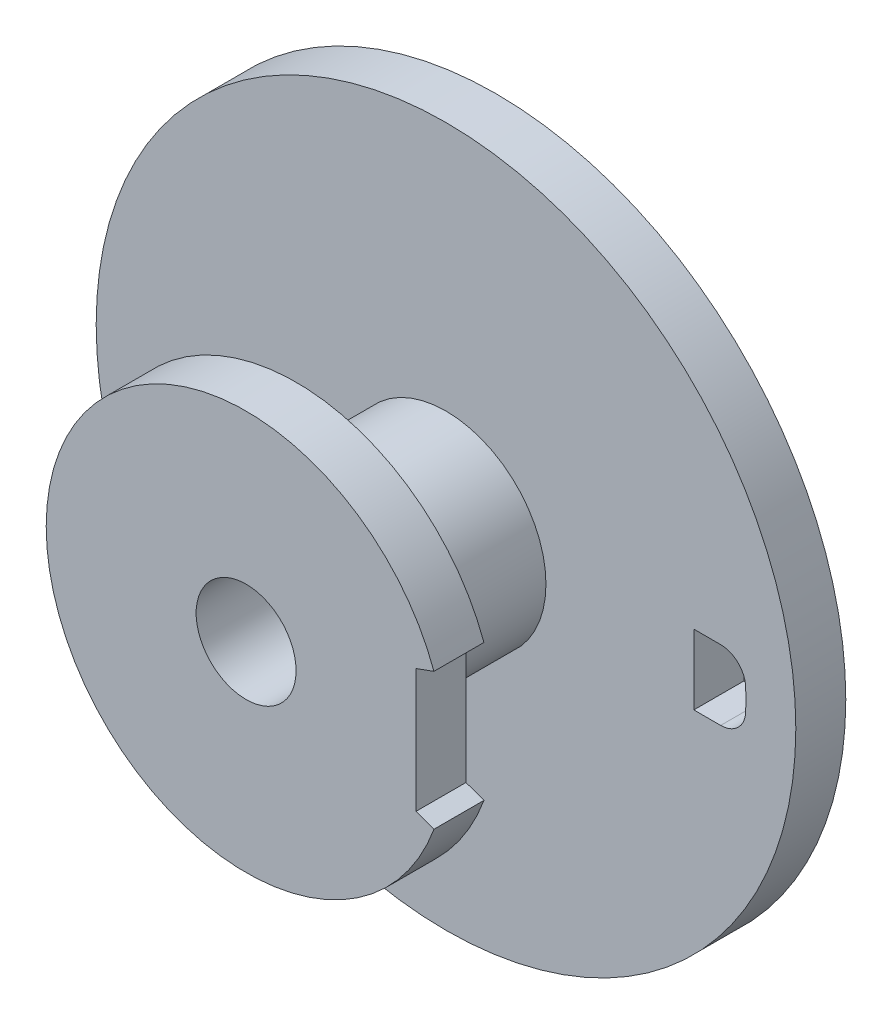
ISO-10303-21;
HEADER;
FILE_DESCRIPTION(('STEP AP214'),'2;1');
FILE_NAME('part.step','',(''),(''),'','','');
FILE_SCHEMA(('AUTOMOTIVE_DESIGN { 1 0 10303 214 1 1 1 1 }'));
ENDSEC;
DATA;
#1=APPLICATION_CONTEXT('core data for automotive mechanical design processes');
#2=APPLICATION_PROTOCOL_DEFINITION('international standard','automotive_design',2000,#1);
#3=PRODUCT_CONTEXT('',#1,'mechanical');
#4=PRODUCT('Part','Part','',(#3));
#5=PRODUCT_RELATED_PRODUCT_CATEGORY('part','',(#4));
#6=PRODUCT_DEFINITION_FORMATION('','',#4);
#7=PRODUCT_DEFINITION_CONTEXT('part definition',#1,'design');
#8=PRODUCT_DEFINITION('design','',#6,#7);
#9=PRODUCT_DEFINITION_SHAPE('','',#8);
#10=(LENGTH_UNIT() NAMED_UNIT(*) SI_UNIT(.MILLI.,.METRE.));
#11=(NAMED_UNIT(*) PLANE_ANGLE_UNIT() SI_UNIT($,.RADIAN.));
#12=(NAMED_UNIT(*) SI_UNIT($,.STERADIAN.) SOLID_ANGLE_UNIT());
#13=UNCERTAINTY_MEASURE_WITH_UNIT(LENGTH_MEASURE(1.E-05),#10,'distance_accuracy_value','');
#14=(GEOMETRIC_REPRESENTATION_CONTEXT(3) GLOBAL_UNCERTAINTY_ASSIGNED_CONTEXT((#13)) GLOBAL_UNIT_ASSIGNED_CONTEXT((#10,
#11,#12)) REPRESENTATION_CONTEXT('',''));
#15=CARTESIAN_POINT('',(0.,0.,0.));
#16=DIRECTION('',(0.,0.,1.));
#17=DIRECTION('',(1.,0.,0.));
#18=AXIS2_PLACEMENT_3D('',#15,#16,#17);
#19=CARTESIAN_POINT('',(0.,0.,-0.75));
#20=DIRECTION('',(0.,0.,1.));
#21=DIRECTION('',(1.,0.,0.));
#22=AXIS2_PLACEMENT_3D('',#19,#20,#21);
#23=CYLINDRICAL_SURFACE('',#22,0.5);
#24=CARTESIAN_POINT('',(0.,0.,-0.75));
#25=DIRECTION('',(0.,0.,-1.));
#26=DIRECTION('',(-1.,0.,0.));
#27=AXIS2_PLACEMENT_3D('',#24,#25,#26);
#28=CIRCLE('',#27,0.5);
#29=CARTESIAN_POINT('',(-0.5,0.,-0.75));
#30=VERTEX_POINT('',#29);
#31=EDGE_CURVE('E165',#30,#30,#28,.F.);
#32=ORIENTED_EDGE('',*,*,#31,.T.);
#33=EDGE_LOOP('',(#32));
#34=FACE_BOUND('',#33,.T.);
#35=CARTESIAN_POINT('',(0.,0.,0.));
#36=DIRECTION('',(0.,0.,1.));
#37=DIRECTION('',(1.,0.,0.));
#38=AXIS2_PLACEMENT_3D('',#35,#36,#37);
#39=CIRCLE('',#38,0.5);
#40=CARTESIAN_POINT('',(0.5,0.,0.));
#41=VERTEX_POINT('',#40);
#42=EDGE_CURVE('E11',#41,#41,#39,.T.);
#43=ORIENTED_EDGE('',*,*,#42,.F.);
#44=EDGE_LOOP('',(#43));
#45=FACE_BOUND('',#44,.T.);
#46=ADVANCED_FACE('F34',(#34,#45),#23,.T.);
#47=CARTESIAN_POINT('',(0.,0.,-0.75));
#48=DIRECTION('',(0.,0.,1.));
#49=DIRECTION('',(1.,0.,0.));
#50=AXIS2_PLACEMENT_3D('',#47,#48,#49);
#51=CYLINDRICAL_SURFACE('',#50,0.25);
#52=CARTESIAN_POINT('',(0.,0.,0.25));
#53=DIRECTION('',(0.,0.,1.));
#54=DIRECTION('',(1.,0.,0.));
#55=AXIS2_PLACEMENT_3D('',#52,#53,#54);
#56=CIRCLE('',#55,0.25);
#57=CARTESIAN_POINT('',(0.25,0.,0.25));
#58=VERTEX_POINT('',#57);
#59=EDGE_CURVE('E170',#58,#58,#56,.T.);
#60=ORIENTED_EDGE('',*,*,#59,.T.);
#61=EDGE_LOOP('',(#60));
#62=FACE_BOUND('',#61,.T.);
#63=CARTESIAN_POINT('',(0.,0.,-1.));
#64=DIRECTION('',(0.,0.,-1.));
#65=DIRECTION('',(-1.,0.,0.));
#66=AXIS2_PLACEMENT_3D('',#63,#64,#65);
#67=CIRCLE('',#66,0.25);
#68=CARTESIAN_POINT('',(-0.25,0.,-1.));
#69=VERTEX_POINT('',#68);
#70=EDGE_CURVE('E124',#69,#69,#67,.T.);
#71=ORIENTED_EDGE('',*,*,#70,.T.);
#72=EDGE_LOOP('',(#71));
#73=FACE_BOUND('',#72,.T.);
#74=ADVANCED_FACE('F233',(#62,#73),#51,.F.);
#75=CARTESIAN_POINT('',(0.,0.,0.25));
#76=DIRECTION('',(0.,0.,1.));
#77=DIRECTION('',(1.,0.,0.));
#78=AXIS2_PLACEMENT_3D('',#75,#76,#77);
#79=PLANE('',#78);
#80=CARTESIAN_POINT('',(0.,0.,0.25));
#81=DIRECTION('',(0.,0.,1.));
#82=DIRECTION('',(1.,0.,0.));
#83=AXIS2_PLACEMENT_3D('',#80,#81,#82);
#84=CIRCLE('',#83,1.);
#85=CARTESIAN_POINT('',(0.939692620785908,0.342020143325669,0.25));
#86=VERTEX_POINT('',#85);
#87=CARTESIAN_POINT('',(0.939692620785908,-0.342020143325669,0.25));
#88=VERTEX_POINT('',#87);
#89=EDGE_CURVE('E174',#86,#88,#84,.T.);
#90=ORIENTED_EDGE('',*,*,#89,.T.);
#91=DIRECTION('',(-0.939692620785908,0.34202014332567,0.));
#92=VECTOR('',#91,1.);
#93=CARTESIAN_POINT('',(0.85,-0.309374699126273,0.25));
#94=LINE('',#93,#92);
#95=CARTESIAN_POINT('',(0.85,-0.309374699126273,0.25));
#96=VERTEX_POINT('',#95);
#97=EDGE_CURVE('E176',#88,#96,#94,.T.);
#98=ORIENTED_EDGE('',*,*,#97,.T.);
#99=DIRECTION('',(0.,1.,0.));
#100=VECTOR('',#99,1.);
#101=CARTESIAN_POINT('',(0.85,0.309374699126273,0.25));
#102=LINE('',#101,#100);
#103=CARTESIAN_POINT('',(0.85,0.309374699126273,0.25));
#104=VERTEX_POINT('',#103);
#105=EDGE_CURVE('E179',#96,#104,#102,.T.);
#106=ORIENTED_EDGE('',*,*,#105,.T.);
#107=DIRECTION('',(0.939692620785908,0.342020143325669,0.));
#108=VECTOR('',#107,1.);
#109=CARTESIAN_POINT('',(0.85,0.309374699126273,0.25));
#110=LINE('',#109,#108);
#111=EDGE_CURVE('E181',#104,#86,#110,.T.);
#112=ORIENTED_EDGE('',*,*,#111,.T.);
#113=EDGE_LOOP('',(#90,#98,#106,#112));
#114=FACE_BOUND('',#113,.T.);
#115=ORIENTED_EDGE('',*,*,#59,.F.);
#116=EDGE_LOOP('',(#115));
#117=FACE_BOUND('',#116,.T.);
#118=ADVANCED_FACE('F220',(#114,#117),#79,.T.);
#119=CARTESIAN_POINT('',(0.,0.,0.));
#120=DIRECTION('',(0.,0.,1.));
#121=DIRECTION('',(1.,0.,0.));
#122=AXIS2_PLACEMENT_3D('',#119,#120,#121);
#123=PLANE('',#122);
#124=ORIENTED_EDGE('',*,*,#42,.T.);
#125=EDGE_LOOP('',(#124));
#126=FACE_BOUND('',#125,.T.);
#127=CARTESIAN_POINT('',(0.,0.,0.));
#128=DIRECTION('',(0.,0.,1.));
#129=DIRECTION('',(1.,0.,0.));
#130=AXIS2_PLACEMENT_3D('',#127,#128,#129);
#131=CIRCLE('',#130,1.);
#132=CARTESIAN_POINT('',(0.939692620785908,0.342020143325669,0.));
#133=VERTEX_POINT('',#132);
#134=CARTESIAN_POINT('',(0.939692620785908,-0.342020143325669,0.));
#135=VERTEX_POINT('',#134);
#136=EDGE_CURVE('E173',#133,#135,#131,.T.);
#137=ORIENTED_EDGE('',*,*,#136,.F.);
#138=DIRECTION('',(0.939692620785908,0.342020143325669,0.));
#139=VECTOR('',#138,1.);
#140=CARTESIAN_POINT('',(0.85,0.309374699126273,0.));
#141=LINE('',#140,#139);
#142=CARTESIAN_POINT('',(0.85,0.309374699126273,0.));
#143=VERTEX_POINT('',#142);
#144=EDGE_CURVE('E177',#143,#133,#141,.T.);
#145=ORIENTED_EDGE('',*,*,#144,.F.);
#146=DIRECTION('',(0.,1.,0.));
#147=VECTOR('',#146,1.);
#148=CARTESIAN_POINT('',(0.85,0.309374699126273,0.));
#149=LINE('',#148,#147);
#150=CARTESIAN_POINT('',(0.85,-0.309374699126273,0.));
#151=VERTEX_POINT('',#150);
#152=EDGE_CURVE('E187',#151,#143,#149,.T.);
#153=ORIENTED_EDGE('',*,*,#152,.F.);
#154=DIRECTION('',(-0.939692620785908,0.34202014332567,0.));
#155=VECTOR('',#154,1.);
#156=CARTESIAN_POINT('',(0.85,-0.309374699126273,0.));
#157=LINE('',#156,#155);
#158=EDGE_CURVE('E185',#135,#151,#157,.T.);
#159=ORIENTED_EDGE('',*,*,#158,.F.);
#160=EDGE_LOOP('',(#137,#145,#153,#159));
#161=FACE_BOUND('',#160,.T.);
#162=ADVANCED_FACE('F209',(#126,#161),#123,.F.);
#163=CARTESIAN_POINT('',(0.,0.,0.25));
#164=DIRECTION('',(0.,0.,-1.));
#165=DIRECTION('',(-1.,0.,0.));
#166=AXIS2_PLACEMENT_3D('',#163,#164,#165);
#167=CYLINDRICAL_SURFACE('',#166,1.);
#168=ORIENTED_EDGE('',*,*,#136,.T.);
#169=DIRECTION('',(0.,0.,-1.));
#170=VECTOR('',#169,1.);
#171=CARTESIAN_POINT('',(0.939692620785908,-0.342020143325669,0.25));
#172=LINE('',#171,#170);
#173=EDGE_CURVE('E41',#88,#135,#172,.T.);
#174=ORIENTED_EDGE('',*,*,#173,.F.);
#175=ORIENTED_EDGE('',*,*,#89,.F.);
#176=DIRECTION('',(0.,0.,-1.));
#177=VECTOR('',#176,1.);
#178=CARTESIAN_POINT('',(0.939692620785908,0.342020143325669,0.25));
#179=LINE('',#178,#177);
#180=EDGE_CURVE('E183',#86,#133,#179,.T.);
#181=ORIENTED_EDGE('',*,*,#180,.T.);
#182=EDGE_LOOP('',(#168,#174,#175,#181));
#183=FACE_BOUND('',#182,.T.);
#184=ADVANCED_FACE('F222',(#183),#167,.T.);
#185=CARTESIAN_POINT('',(0.85,-0.309374699126273,0.25));
#186=DIRECTION('',(-0.34202014332567,-0.939692620785908,0.));
#187=DIRECTION('',(0.939692620785908,-0.34202014332567,0.));
#188=AXIS2_PLACEMENT_3D('',#185,#186,#187);
#189=PLANE('',#188);
#190=ORIENTED_EDGE('',*,*,#158,.T.);
#191=DIRECTION('',(0.,0.,-1.));
#192=VECTOR('',#191,1.);
#193=CARTESIAN_POINT('',(0.85,-0.309374699126273,0.25));
#194=LINE('',#193,#192);
#195=EDGE_CURVE('E196',#96,#151,#194,.T.);
#196=ORIENTED_EDGE('',*,*,#195,.F.);
#197=ORIENTED_EDGE('',*,*,#97,.F.);
#198=ORIENTED_EDGE('',*,*,#173,.T.);
#199=EDGE_LOOP('',(#190,#196,#197,#198));
#200=FACE_BOUND('',#199,.T.);
#201=ADVANCED_FACE('F203',(#200),#189,.F.);
#202=CARTESIAN_POINT('',(0.85,0.309374699126273,0.25));
#203=DIRECTION('',(-1.,0.,0.));
#204=DIRECTION('',(0.,-1.,0.));
#205=AXIS2_PLACEMENT_3D('',#202,#203,#204);
#206=PLANE('',#205);
#207=ORIENTED_EDGE('',*,*,#152,.T.);
#208=DIRECTION('',(0.,0.,-1.));
#209=VECTOR('',#208,1.);
#210=CARTESIAN_POINT('',(0.85,0.309374699126273,0.25));
#211=LINE('',#210,#209);
#212=EDGE_CURVE('E193',#104,#143,#211,.T.);
#213=ORIENTED_EDGE('',*,*,#212,.F.);
#214=ORIENTED_EDGE('',*,*,#105,.F.);
#215=ORIENTED_EDGE('',*,*,#195,.T.);
#216=EDGE_LOOP('',(#207,#213,#214,#215));
#217=FACE_BOUND('',#216,.T.);
#218=ADVANCED_FACE('F213',(#217),#206,.F.);
#219=CARTESIAN_POINT('',(0.85,0.309374699126273,0.25));
#220=DIRECTION('',(-0.342020143325669,0.939692620785908,0.));
#221=DIRECTION('',(-0.939692620785908,-0.342020143325669,0.));
#222=AXIS2_PLACEMENT_3D('',#219,#220,#221);
#223=PLANE('',#222);
#224=ORIENTED_EDGE('',*,*,#144,.T.);
#225=ORIENTED_EDGE('',*,*,#180,.F.);
#226=ORIENTED_EDGE('',*,*,#111,.F.);
#227=ORIENTED_EDGE('',*,*,#212,.T.);
#228=EDGE_LOOP('',(#224,#225,#226,#227));
#229=FACE_BOUND('',#228,.T.);
#230=ADVANCED_FACE('F217',(#229),#223,.F.);
#231=CARTESIAN_POINT('',(0.,0.,-1.));
#232=DIRECTION('',(0.,0.,-1.));
#233=DIRECTION('',(-1.,0.,0.));
#234=AXIS2_PLACEMENT_3D('',#231,#232,#233);
#235=PLANE('',#234);
#236=DIRECTION('',(0.,1.,0.));
#237=VECTOR('',#236,1.);
#238=CARTESIAN_POINT('',(1.23975669154396,0.175,-1.));
#239=LINE('',#238,#237);
#240=CARTESIAN_POINT('',(1.23975669154396,-0.175,-1.));
#241=VERTEX_POINT('',#240);
#242=CARTESIAN_POINT('',(1.23975669154396,0.175,-1.));
#243=VERTEX_POINT('',#242);
#244=EDGE_CURVE('E48',#241,#243,#239,.T.);
#245=ORIENTED_EDGE('',*,*,#244,.F.);
#246=DIRECTION('',(-1.,0.,0.));
#247=VECTOR('',#246,1.);
#248=CARTESIAN_POINT('',(1.23975669154396,-0.175,-1.));
#249=LINE('',#248,#247);
#250=CARTESIAN_POINT('',(1.37409060836613,-0.175,-1.));
#251=VERTEX_POINT('',#250);
#252=EDGE_CURVE('E118',#251,#241,#249,.T.);
#253=ORIENTED_EDGE('',*,*,#252,.F.);
#254=CARTESIAN_POINT('',(1.37409060836613,-0.05,-1.));
#255=DIRECTION('',(0.,0.,-1.));
#256=DIRECTION('',(1.,0.,0.));
#257=AXIS2_PLACEMENT_3D('',#254,#255,#256);
#258=CIRCLE('',#257,0.125);
#259=CARTESIAN_POINT('',(1.49900793639941,-0.0545454545454545,-1.));
#260=VERTEX_POINT('',#259);
#261=EDGE_CURVE('E146',#260,#251,#258,.T.);
#262=ORIENTED_EDGE('',*,*,#261,.F.);
#263=CARTESIAN_POINT('',(0.,0.,-1.));
#264=DIRECTION('',(0.,0.,-1.));
#265=DIRECTION('',(-1.,0.,0.));
#266=AXIS2_PLACEMENT_3D('',#263,#264,#265);
#267=CIRCLE('',#266,1.5);
#268=CARTESIAN_POINT('',(1.49900793639941,0.0545454545454546,-1.));
#269=VERTEX_POINT('',#268);
#270=EDGE_CURVE('E143',#269,#260,#267,.T.);
#271=ORIENTED_EDGE('',*,*,#270,.F.);
#272=CARTESIAN_POINT('',(1.37409060836613,0.05,-1.));
#273=DIRECTION('',(0.,0.,-1.));
#274=DIRECTION('',(-1.,0.,0.));
#275=AXIS2_PLACEMENT_3D('',#272,#273,#274);
#276=CIRCLE('',#275,0.125);
#277=CARTESIAN_POINT('',(1.37409060836613,0.175,-1.));
#278=VERTEX_POINT('',#277);
#279=EDGE_CURVE('E140',#278,#269,#276,.T.);
#280=ORIENTED_EDGE('',*,*,#279,.F.);
#281=DIRECTION('',(1.,0.,0.));
#282=VECTOR('',#281,1.);
#283=CARTESIAN_POINT('',(1.37409060836613,0.175,-1.));
#284=LINE('',#283,#282);
#285=EDGE_CURVE('E133',#243,#278,#284,.T.);
#286=ORIENTED_EDGE('',*,*,#285,.F.);
#287=EDGE_LOOP('',(#245,#253,#262,#271,#280,#286));
#288=FACE_BOUND('',#287,.T.);
#289=CARTESIAN_POINT('',(0.,0.,-1.));
#290=DIRECTION('',(0.,0.,-1.));
#291=DIRECTION('',(-1.,0.,0.));
#292=AXIS2_PLACEMENT_3D('',#289,#290,#291);
#293=CIRCLE('',#292,1.75);
#294=CARTESIAN_POINT('',(-1.75,0.,-1.));
#295=VERTEX_POINT('',#294);
#296=EDGE_CURVE('E162',#295,#295,#293,.T.);
#297=ORIENTED_EDGE('',*,*,#296,.T.);
#298=EDGE_LOOP('',(#297));
#299=FACE_BOUND('',#298,.T.);
#300=ORIENTED_EDGE('',*,*,#70,.F.);
#301=EDGE_LOOP('',(#300));
#302=FACE_BOUND('',#301,.T.);
#303=ADVANCED_FACE('F245',(#288,#299,#302),#235,.T.);
#304=CARTESIAN_POINT('',(0.,0.,-0.75));
#305=DIRECTION('',(0.,0.,-1.));
#306=DIRECTION('',(-1.,0.,0.));
#307=AXIS2_PLACEMENT_3D('',#304,#305,#306);
#308=PLANE('',#307);
#309=DIRECTION('',(1.,0.,0.));
#310=VECTOR('',#309,1.);
#311=CARTESIAN_POINT('',(1.23975669154396,-0.175,-0.75));
#312=LINE('',#311,#310);
#313=CARTESIAN_POINT('',(1.23975669154396,-0.175,-0.75));
#314=VERTEX_POINT('',#313);
#315=CARTESIAN_POINT('',(1.37409060836613,-0.175,-0.75));
#316=VERTEX_POINT('',#315);
#317=EDGE_CURVE('E131',#314,#316,#312,.T.);
#318=ORIENTED_EDGE('',*,*,#317,.F.);
#319=DIRECTION('',(0.,-1.,0.));
#320=VECTOR('',#319,1.);
#321=CARTESIAN_POINT('',(1.23975669154396,0.175,-0.75));
#322=LINE('',#321,#320);
#323=CARTESIAN_POINT('',(1.23975669154396,0.175,-0.75));
#324=VERTEX_POINT('',#323);
#325=EDGE_CURVE('E112',#324,#314,#322,.T.);
#326=ORIENTED_EDGE('',*,*,#325,.F.);
#327=DIRECTION('',(-1.,0.,0.));
#328=VECTOR('',#327,1.);
#329=CARTESIAN_POINT('',(1.37409060836613,0.175,-0.75));
#330=LINE('',#329,#328);
#331=CARTESIAN_POINT('',(1.37409060836613,0.175,-0.75));
#332=VERTEX_POINT('',#331);
#333=EDGE_CURVE('E121',#332,#324,#330,.T.);
#334=ORIENTED_EDGE('',*,*,#333,.F.);
#335=CARTESIAN_POINT('',(1.37409060836613,0.05,-0.75));
#336=DIRECTION('',(0.,0.,-1.));
#337=DIRECTION('',(-1.,0.,0.));
#338=AXIS2_PLACEMENT_3D('',#335,#336,#337);
#339=CIRCLE('',#338,0.125);
#340=CARTESIAN_POINT('',(1.49900793639941,0.0545454545454546,-0.75));
#341=VERTEX_POINT('',#340);
#342=EDGE_CURVE('E56',#341,#332,#339,.F.);
#343=ORIENTED_EDGE('',*,*,#342,.F.);
#344=CARTESIAN_POINT('',(0.,0.,-0.75));
#345=DIRECTION('',(0.,0.,-1.));
#346=DIRECTION('',(-1.,0.,0.));
#347=AXIS2_PLACEMENT_3D('',#344,#345,#346);
#348=CIRCLE('',#347,1.5);
#349=CARTESIAN_POINT('',(1.49900793639941,-0.0545454545454545,-0.75));
#350=VERTEX_POINT('',#349);
#351=EDGE_CURVE('E406',#350,#341,#348,.F.);
#352=ORIENTED_EDGE('',*,*,#351,.F.);
#353=CARTESIAN_POINT('',(1.37409060836613,-0.05,-0.75));
#354=DIRECTION('',(0.,0.,-1.));
#355=DIRECTION('',(-1.,0.,0.));
#356=AXIS2_PLACEMENT_3D('',#353,#354,#355);
#357=CIRCLE('',#356,0.125);
#358=EDGE_CURVE('E135',#316,#350,#357,.F.);
#359=ORIENTED_EDGE('',*,*,#358,.F.);
#360=EDGE_LOOP('',(#318,#326,#334,#343,#352,#359));
#361=FACE_BOUND('',#360,.T.);
#362=ORIENTED_EDGE('',*,*,#31,.F.);
#363=EDGE_LOOP('',(#362));
#364=FACE_BOUND('',#363,.T.);
#365=CARTESIAN_POINT('',(0.,0.,-0.75));
#366=DIRECTION('',(0.,0.,-1.));
#367=DIRECTION('',(-1.,0.,0.));
#368=AXIS2_PLACEMENT_3D('',#365,#366,#367);
#369=CIRCLE('',#368,1.75);
#370=CARTESIAN_POINT('',(-1.75,0.,-0.75));
#371=VERTEX_POINT('',#370);
#372=EDGE_CURVE('E161',#371,#371,#369,.T.);
#373=ORIENTED_EDGE('',*,*,#372,.F.);
#374=EDGE_LOOP('',(#373));
#375=FACE_BOUND('',#374,.T.);
#376=ADVANCED_FACE('F127',(#361,#364,#375),#308,.F.);
#377=CARTESIAN_POINT('',(0.,0.,-1.));
#378=DIRECTION('',(0.,0.,1.));
#379=DIRECTION('',(1.,0.,0.));
#380=AXIS2_PLACEMENT_3D('',#377,#378,#379);
#381=CYLINDRICAL_SURFACE('',#380,1.75);
#382=ORIENTED_EDGE('',*,*,#296,.F.);
#383=EDGE_LOOP('',(#382));
#384=FACE_BOUND('',#383,.T.);
#385=ORIENTED_EDGE('',*,*,#372,.T.);
#386=EDGE_LOOP('',(#385));
#387=FACE_BOUND('',#386,.T.);
#388=ADVANCED_FACE('F244',(#384,#387),#381,.T.);
#389=CARTESIAN_POINT('',(1.23975669154396,0.175,0.251));
#390=DIRECTION('',(-1.,0.,0.));
#391=DIRECTION('',(0.,-1.,0.));
#392=AXIS2_PLACEMENT_3D('',#389,#390,#391);
#393=PLANE('',#392);
#394=ORIENTED_EDGE('',*,*,#325,.T.);
#395=DIRECTION('',(0.,0.,-1.));
#396=VECTOR('',#395,1.);
#397=CARTESIAN_POINT('',(1.23975669154396,-0.175,0.251));
#398=LINE('',#397,#396);
#399=EDGE_CURVE('E125',#314,#241,#398,.T.);
#400=ORIENTED_EDGE('',*,*,#399,.T.);
#401=ORIENTED_EDGE('',*,*,#244,.T.);
#402=DIRECTION('',(0.,0.,-1.));
#403=VECTOR('',#402,1.);
#404=CARTESIAN_POINT('',(1.23975669154396,0.175,0.251));
#405=LINE('',#404,#403);
#406=EDGE_CURVE('E108',#324,#243,#405,.T.);
#407=ORIENTED_EDGE('',*,*,#406,.F.);
#408=EDGE_LOOP('',(#394,#400,#401,#407));
#409=FACE_BOUND('',#408,.T.);
#410=ADVANCED_FACE('F110',(#409),#393,.F.);
#411=CARTESIAN_POINT('',(1.23975669154396,-0.175,0.251));
#412=DIRECTION('',(0.,-1.,0.));
#413=DIRECTION('',(1.,0.,0.));
#414=AXIS2_PLACEMENT_3D('',#411,#412,#413);
#415=PLANE('',#414);
#416=ORIENTED_EDGE('',*,*,#317,.T.);
#417=DIRECTION('',(0.,0.,-1.));
#418=VECTOR('',#417,1.);
#419=CARTESIAN_POINT('',(1.37409060836613,-0.175,0.251));
#420=LINE('',#419,#418);
#421=EDGE_CURVE('E152',#316,#251,#420,.T.);
#422=ORIENTED_EDGE('',*,*,#421,.T.);
#423=ORIENTED_EDGE('',*,*,#252,.T.);
#424=ORIENTED_EDGE('',*,*,#399,.F.);
#425=EDGE_LOOP('',(#416,#422,#423,#424));
#426=FACE_BOUND('',#425,.T.);
#427=ADVANCED_FACE('F255',(#426),#415,.F.);
#428=CARTESIAN_POINT('',(1.37409060836613,-0.05,0.251));
#429=DIRECTION('',(0.,0.,-1.));
#430=DIRECTION('',(-1.,0.,0.));
#431=AXIS2_PLACEMENT_3D('',#428,#429,#430);
#432=CYLINDRICAL_SURFACE('',#431,0.125);
#433=ORIENTED_EDGE('',*,*,#358,.T.);
#434=DIRECTION('',(0.,0.,-1.));
#435=VECTOR('',#434,1.);
#436=CARTESIAN_POINT('',(1.49900793639941,-0.0545454545454545,0.251));
#437=LINE('',#436,#435);
#438=EDGE_CURVE('E154',#350,#260,#437,.T.);
#439=ORIENTED_EDGE('',*,*,#438,.T.);
#440=ORIENTED_EDGE('',*,*,#261,.T.);
#441=ORIENTED_EDGE('',*,*,#421,.F.);
#442=EDGE_LOOP('',(#433,#439,#440,#441));
#443=FACE_BOUND('',#442,.T.);
#444=ADVANCED_FACE('F363',(#443),#432,.F.);
#445=CARTESIAN_POINT('',(0.,0.,0.251));
#446=DIRECTION('',(0.,0.,-1.));
#447=DIRECTION('',(-1.,0.,0.));
#448=AXIS2_PLACEMENT_3D('',#445,#446,#447);
#449=CYLINDRICAL_SURFACE('',#448,1.5);
#450=ORIENTED_EDGE('',*,*,#351,.T.);
#451=DIRECTION('',(0.,0.,-1.));
#452=VECTOR('',#451,1.);
#453=CARTESIAN_POINT('',(1.49900793639941,0.0545454545454546,0.251));
#454=LINE('',#453,#452);
#455=EDGE_CURVE('E156',#341,#269,#454,.T.);
#456=ORIENTED_EDGE('',*,*,#455,.T.);
#457=ORIENTED_EDGE('',*,*,#270,.T.);
#458=ORIENTED_EDGE('',*,*,#438,.F.);
#459=EDGE_LOOP('',(#450,#456,#457,#458));
#460=FACE_BOUND('',#459,.T.);
#461=ADVANCED_FACE('F372',(#460),#449,.F.);
#462=CARTESIAN_POINT('',(1.37409060836613,0.05,0.251));
#463=DIRECTION('',(0.,0.,-1.));
#464=DIRECTION('',(-1.,0.,0.));
#465=AXIS2_PLACEMENT_3D('',#462,#463,#464);
#466=CYLINDRICAL_SURFACE('',#465,0.125);
#467=ORIENTED_EDGE('',*,*,#342,.T.);
#468=DIRECTION('',(0.,0.,-1.));
#469=VECTOR('',#468,1.);
#470=CARTESIAN_POINT('',(1.37409060836613,0.175,0.251));
#471=LINE('',#470,#469);
#472=EDGE_CURVE('E117',#332,#278,#471,.T.);
#473=ORIENTED_EDGE('',*,*,#472,.T.);
#474=ORIENTED_EDGE('',*,*,#279,.T.);
#475=ORIENTED_EDGE('',*,*,#455,.F.);
#476=EDGE_LOOP('',(#467,#473,#474,#475));
#477=FACE_BOUND('',#476,.T.);
#478=ADVANCED_FACE('F381',(#477),#466,.F.);
#479=CARTESIAN_POINT('',(1.37409060836613,0.175,0.251));
#480=DIRECTION('',(0.,1.,0.));
#481=DIRECTION('',(-1.,0.,0.));
#482=AXIS2_PLACEMENT_3D('',#479,#480,#481);
#483=PLANE('',#482);
#484=ORIENTED_EDGE('',*,*,#333,.T.);
#485=ORIENTED_EDGE('',*,*,#406,.T.);
#486=ORIENTED_EDGE('',*,*,#285,.T.);
#487=ORIENTED_EDGE('',*,*,#472,.F.);
#488=EDGE_LOOP('',(#484,#485,#486,#487));
#489=FACE_BOUND('',#488,.T.);
#490=ADVANCED_FACE('F122',(#489),#483,.F.);
#491=CLOSED_SHELL('',(#46,#74,#118,#162,#184,#201,#218,#230,#303,#376,#388,#410,#427,#444,#461,
#478,#490));
#492=MANIFOLD_SOLID_BREP('B2',#491);
#493=ADVANCED_BREP_SHAPE_REPRESENTATION('',(#18,#492),#14);
#494=SHAPE_DEFINITION_REPRESENTATION(#9,#493);
ENDSEC;
END-ISO-10303-21;
